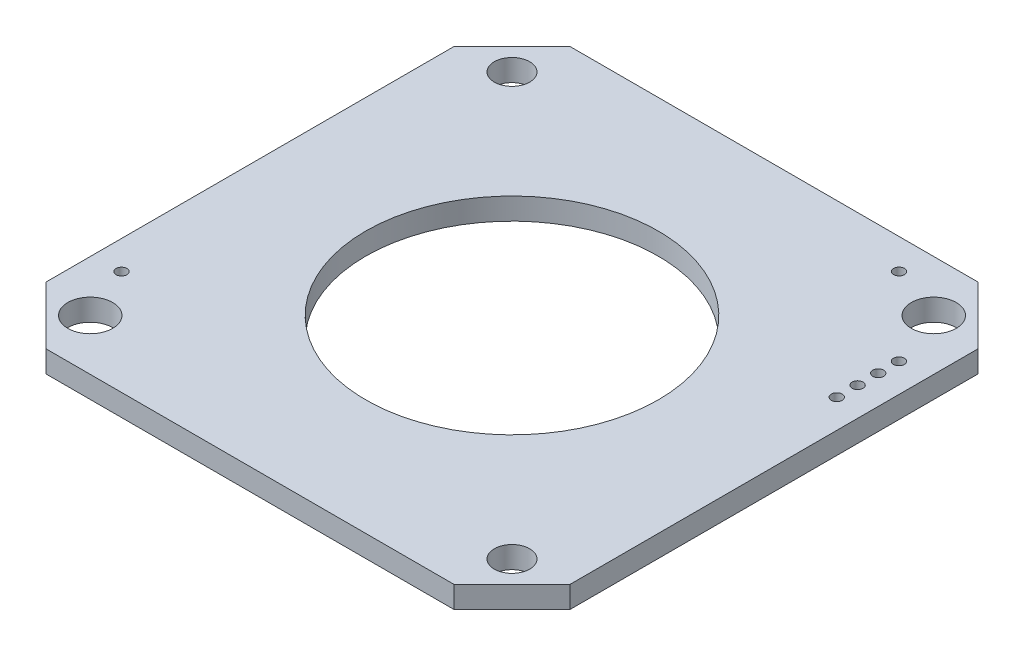
ISO-10303-21;
HEADER;
FILE_DESCRIPTION(('STEP AP214'),'2;1');
FILE_NAME('part.step','',(''),(''),'','','');
FILE_SCHEMA(('AUTOMOTIVE_DESIGN { 1 0 10303 214 1 1 1 1 }'));
ENDSEC;
DATA;
#1=APPLICATION_CONTEXT('core data for automotive mechanical design processes');
#2=APPLICATION_PROTOCOL_DEFINITION('international standard','automotive_design',2000,#1);
#3=PRODUCT_CONTEXT('',#1,'mechanical');
#4=PRODUCT('Part','Part','',(#3));
#5=PRODUCT_RELATED_PRODUCT_CATEGORY('part','',(#4));
#6=PRODUCT_DEFINITION_FORMATION('','',#4);
#7=PRODUCT_DEFINITION_CONTEXT('part definition',#1,'design');
#8=PRODUCT_DEFINITION('design','',#6,#7);
#9=PRODUCT_DEFINITION_SHAPE('','',#8);
#10=(LENGTH_UNIT() NAMED_UNIT(*) SI_UNIT(.MILLI.,.METRE.));
#11=(NAMED_UNIT(*) PLANE_ANGLE_UNIT() SI_UNIT($,.RADIAN.));
#12=(NAMED_UNIT(*) SI_UNIT($,.STERADIAN.) SOLID_ANGLE_UNIT());
#13=UNCERTAINTY_MEASURE_WITH_UNIT(LENGTH_MEASURE(1.E-05),#10,'distance_accuracy_value','');
#14=(GEOMETRIC_REPRESENTATION_CONTEXT(3) GLOBAL_UNCERTAINTY_ASSIGNED_CONTEXT((#13)) GLOBAL_UNIT_ASSIGNED_CONTEXT((#10,
#11,#12)) REPRESENTATION_CONTEXT('',''));
#15=CARTESIAN_POINT('',(0.,0.,0.));
#16=DIRECTION('',(0.,0.,1.));
#17=DIRECTION('',(1.,0.,0.));
#18=AXIS2_PLACEMENT_3D('',#15,#16,#17);
#19=CARTESIAN_POINT('',(0.,0.,0.));
#20=DIRECTION('',(0.,1.,0.));
#21=DIRECTION('',(1.,0.,0.));
#22=AXIS2_PLACEMENT_3D('',#19,#20,#21);
#23=PLANE('',#22);
#24=DIRECTION('',(0.,0.,-1.));
#25=VECTOR('',#24,1.);
#26=CARTESIAN_POINT('',(19.25,0.,15.));
#27=LINE('',#26,#25);
#28=CARTESIAN_POINT('',(19.25,0.,15.));
#29=VERTEX_POINT('',#28);
#30=CARTESIAN_POINT('',(19.25,0.,-15.));
#31=VERTEX_POINT('',#30);
#32=EDGE_CURVE('E36',#29,#31,#27,.T.);
#33=ORIENTED_EDGE('',*,*,#32,.F.);
#34=DIRECTION('',(0.707106781186548,0.,-0.707106781186548));
#35=VECTOR('',#34,1.);
#36=CARTESIAN_POINT('',(15.,0.,19.25));
#37=LINE('',#36,#35);
#38=CARTESIAN_POINT('',(15.,0.,19.25));
#39=VERTEX_POINT('',#38);
#40=EDGE_CURVE('E134',#39,#29,#37,.T.);
#41=ORIENTED_EDGE('',*,*,#40,.F.);
#42=DIRECTION('',(1.,0.,0.));
#43=VECTOR('',#42,1.);
#44=CARTESIAN_POINT('',(-15.,0.,19.25));
#45=LINE('',#44,#43);
#46=CARTESIAN_POINT('',(-15.,0.,19.25));
#47=VERTEX_POINT('',#46);
#48=EDGE_CURVE('E131',#47,#39,#45,.T.);
#49=ORIENTED_EDGE('',*,*,#48,.F.);
#50=DIRECTION('',(0.707106781186548,0.,0.707106781186548));
#51=VECTOR('',#50,1.);
#52=CARTESIAN_POINT('',(-19.25,0.,15.));
#53=LINE('',#52,#51);
#54=CARTESIAN_POINT('',(-19.25,0.,15.));
#55=VERTEX_POINT('',#54);
#56=EDGE_CURVE('E128',#55,#47,#53,.T.);
#57=ORIENTED_EDGE('',*,*,#56,.F.);
#58=DIRECTION('',(0.,0.,1.));
#59=VECTOR('',#58,1.);
#60=CARTESIAN_POINT('',(-19.25,0.,-15.));
#61=LINE('',#60,#59);
#62=CARTESIAN_POINT('',(-19.25,0.,-15.));
#63=VERTEX_POINT('',#62);
#64=EDGE_CURVE('E124',#63,#55,#61,.T.);
#65=ORIENTED_EDGE('',*,*,#64,.F.);
#66=DIRECTION('',(-0.707106781186548,0.,0.707106781186548));
#67=VECTOR('',#66,1.);
#68=CARTESIAN_POINT('',(-15.,0.,-19.25));
#69=LINE('',#68,#67);
#70=CARTESIAN_POINT('',(-15.,0.,-19.25));
#71=VERTEX_POINT('',#70);
#72=EDGE_CURVE('E120',#71,#63,#69,.T.);
#73=ORIENTED_EDGE('',*,*,#72,.F.);
#74=DIRECTION('',(-1.,0.,0.));
#75=VECTOR('',#74,1.);
#76=CARTESIAN_POINT('',(15.,0.,-19.25));
#77=LINE('',#76,#75);
#78=CARTESIAN_POINT('',(15.,0.,-19.25));
#79=VERTEX_POINT('',#78);
#80=EDGE_CURVE('E116',#79,#71,#77,.T.);
#81=ORIENTED_EDGE('',*,*,#80,.F.);
#82=DIRECTION('',(-0.707106781186548,0.,-0.707106781186548));
#83=VECTOR('',#82,1.);
#84=CARTESIAN_POINT('',(19.25,0.,-15.));
#85=LINE('',#84,#83);
#86=EDGE_CURVE('E115',#31,#79,#85,.T.);
#87=ORIENTED_EDGE('',*,*,#86,.F.);
#88=EDGE_LOOP('',(#33,#41,#49,#57,#65,#73,#81,#87));
#89=FACE_BOUND('',#88,.T.);
#90=CARTESIAN_POINT('',(0.,0.,0.));
#91=DIRECTION('',(0.,1.,0.));
#92=DIRECTION('',(-1.,0.,0.));
#93=AXIS2_PLACEMENT_3D('',#90,#91,#92);
#94=CIRCLE('',#93,10.75);
#95=CARTESIAN_POINT('',(-10.75,0.,0.));
#96=VERTEX_POINT('',#95);
#97=EDGE_CURVE('E11',#96,#96,#94,.T.);
#98=ORIENTED_EDGE('',*,*,#97,.T.);
#99=EDGE_LOOP('',(#98));
#100=FACE_BOUND('',#99,.T.);
#101=CARTESIAN_POINT('',(-15.5,0.,15.5));
#102=DIRECTION('',(0.,1.,0.));
#103=DIRECTION('',(-1.,0.,0.));
#104=AXIS2_PLACEMENT_3D('',#101,#102,#103);
#105=CIRCLE('',#104,1.65);
#106=CARTESIAN_POINT('',(-17.15,0.,15.5));
#107=VERTEX_POINT('',#106);
#108=EDGE_CURVE('E27',#107,#107,#105,.T.);
#109=ORIENTED_EDGE('',*,*,#108,.T.);
#110=EDGE_LOOP('',(#109));
#111=FACE_BOUND('',#110,.T.);
#112=CARTESIAN_POINT('',(15.5,0.,15.5));
#113=DIRECTION('',(0.,1.,0.));
#114=DIRECTION('',(-1.,0.,0.));
#115=AXIS2_PLACEMENT_3D('',#112,#113,#114);
#116=CIRCLE('',#115,1.3);
#117=CARTESIAN_POINT('',(14.2,0.,15.5));
#118=VERTEX_POINT('',#117);
#119=EDGE_CURVE('E153',#118,#118,#116,.T.);
#120=ORIENTED_EDGE('',*,*,#119,.T.);
#121=EDGE_LOOP('',(#120));
#122=FACE_BOUND('',#121,.T.);
#123=CARTESIAN_POINT('',(15.5,0.,-15.5));
#124=DIRECTION('',(0.,1.,0.));
#125=DIRECTION('',(-1.,0.,0.));
#126=AXIS2_PLACEMENT_3D('',#123,#124,#125);
#127=CIRCLE('',#126,1.65);
#128=CARTESIAN_POINT('',(13.85,0.,-15.5));
#129=VERTEX_POINT('',#128);
#130=EDGE_CURVE('E156',#129,#129,#127,.T.);
#131=ORIENTED_EDGE('',*,*,#130,.T.);
#132=EDGE_LOOP('',(#131));
#133=FACE_BOUND('',#132,.T.);
#134=CARTESIAN_POINT('',(-15.5,0.,-15.5));
#135=DIRECTION('',(0.,1.,0.));
#136=DIRECTION('',(-1.,0.,0.));
#137=AXIS2_PLACEMENT_3D('',#134,#135,#136);
#138=CIRCLE('',#137,1.3);
#139=CARTESIAN_POINT('',(-16.8,0.,-15.5));
#140=VERTEX_POINT('',#139);
#141=EDGE_CURVE('E159',#140,#140,#138,.T.);
#142=ORIENTED_EDGE('',*,*,#141,.T.);
#143=EDGE_LOOP('',(#142));
#144=FACE_BOUND('',#143,.T.);
#145=CARTESIAN_POINT('',(-17.14113742206,0.,11.5596073045));
#146=DIRECTION('',(0.,-1.,0.));
#147=DIRECTION('',(0.,0.,1.));
#148=AXIS2_PLACEMENT_3D('',#145,#146,#147);
#149=CIRCLE('',#148,0.4);
#150=CARTESIAN_POINT('',(-17.14113742206,0.,11.9596073045));
#151=VERTEX_POINT('',#150);
#152=EDGE_CURVE('E163',#151,#151,#149,.T.);
#153=ORIENTED_EDGE('',*,*,#152,.F.);
#154=EDGE_LOOP('',(#153));
#155=FACE_BOUND('',#154,.T.);
#156=CARTESIAN_POINT('',(11.42907727857,0.,-17.0201780966));
#157=DIRECTION('',(0.,-1.,0.));
#158=DIRECTION('',(0.,0.,1.));
#159=AXIS2_PLACEMENT_3D('',#156,#157,#158);
#160=CIRCLE('',#159,0.4);
#161=CARTESIAN_POINT('',(11.42907727857,0.,-16.6201780966));
#162=VERTEX_POINT('',#161);
#163=EDGE_CURVE('E167',#162,#162,#160,.T.);
#164=ORIENTED_EDGE('',*,*,#163,.F.);
#165=EDGE_LOOP('',(#164));
#166=FACE_BOUND('',#165,.T.);
#167=CARTESIAN_POINT('',(17.13893829593,0.,-11.30003921933));
#168=DIRECTION('',(0.,-1.,0.));
#169=DIRECTION('',(0.,0.,1.));
#170=AXIS2_PLACEMENT_3D('',#167,#168,#169);
#171=CIRCLE('',#170,0.4);
#172=CARTESIAN_POINT('',(17.13893829593,0.,-10.90003921933));
#173=VERTEX_POINT('',#172);
#174=EDGE_CURVE('E170',#173,#173,#171,.T.);
#175=ORIENTED_EDGE('',*,*,#174,.F.);
#176=EDGE_LOOP('',(#175));
#177=FACE_BOUND('',#176,.T.);
#178=CARTESIAN_POINT('',(17.13892260747,0.,-9.778579219413));
#179=DIRECTION('',(0.,-1.,0.));
#180=DIRECTION('',(0.,0.,1.));
#181=AXIS2_PLACEMENT_3D('',#178,#179,#180);
#182=CIRCLE('',#181,0.4);
#183=CARTESIAN_POINT('',(17.13892260747,0.,-9.378579219413));
#184=VERTEX_POINT('',#183);
#185=EDGE_CURVE('E173',#184,#184,#182,.T.);
#186=ORIENTED_EDGE('',*,*,#185,.F.);
#187=EDGE_LOOP('',(#186));
#188=FACE_BOUND('',#187,.T.);
#189=CARTESIAN_POINT('',(17.13890694519,0.,-8.259659219493));
#190=DIRECTION('',(0.,-1.,0.));
#191=DIRECTION('',(0.,0.,1.));
#192=AXIS2_PLACEMENT_3D('',#189,#190,#191);
#193=CIRCLE('',#192,0.4);
#194=CARTESIAN_POINT('',(17.13890694519,0.,-7.859659219493));
#195=VERTEX_POINT('',#194);
#196=EDGE_CURVE('E176',#195,#195,#193,.T.);
#197=ORIENTED_EDGE('',*,*,#196,.F.);
#198=EDGE_LOOP('',(#197));
#199=FACE_BOUND('',#198,.T.);
#200=CARTESIAN_POINT('',(17.13889117816,0.,-6.730579219575));
#201=DIRECTION('',(0.,-1.,0.));
#202=DIRECTION('',(0.,0.,1.));
#203=AXIS2_PLACEMENT_3D('',#200,#201,#202);
#204=CIRCLE('',#203,0.4);
#205=CARTESIAN_POINT('',(17.13889117816,0.,-6.330579219575));
#206=VERTEX_POINT('',#205);
#207=EDGE_CURVE('E179',#206,#206,#204,.T.);
#208=ORIENTED_EDGE('',*,*,#207,.F.);
#209=EDGE_LOOP('',(#208));
#210=FACE_BOUND('',#209,.T.);
#211=ADVANCED_FACE('F17',(#89,#100,#111,#122,#133,#144,#155,#166,#177,#188,#199,#210),#23,.F.);
#212=CARTESIAN_POINT('',(0.,1.6,0.));
#213=DIRECTION('',(0.,1.,0.));
#214=DIRECTION('',(1.,0.,0.));
#215=AXIS2_PLACEMENT_3D('',#212,#213,#214);
#216=CYLINDRICAL_SURFACE('',#215,10.75);
#217=ORIENTED_EDGE('',*,*,#97,.F.);
#218=EDGE_LOOP('',(#217));
#219=FACE_BOUND('',#218,.T.);
#220=CARTESIAN_POINT('',(0.,1.6,0.));
#221=DIRECTION('',(0.,1.,0.));
#222=DIRECTION('',(1.,0.,0.));
#223=AXIS2_PLACEMENT_3D('',#220,#221,#222);
#224=CIRCLE('',#223,10.75);
#225=CARTESIAN_POINT('',(10.75,1.6,0.));
#226=VERTEX_POINT('',#225);
#227=EDGE_CURVE('E162',#226,#226,#224,.T.);
#228=ORIENTED_EDGE('',*,*,#227,.T.);
#229=EDGE_LOOP('',(#228));
#230=FACE_BOUND('',#229,.T.);
#231=ADVANCED_FACE('F229',(#219,#230),#216,.F.);
#232=CARTESIAN_POINT('',(0.,1.6,0.));
#233=DIRECTION('',(0.,1.,0.));
#234=DIRECTION('',(1.,0.,0.));
#235=AXIS2_PLACEMENT_3D('',#232,#233,#234);
#236=PLANE('',#235);
#237=DIRECTION('',(-1.,0.,0.));
#238=VECTOR('',#237,1.);
#239=CARTESIAN_POINT('',(15.,1.6,-19.25));
#240=LINE('',#239,#238);
#241=CARTESIAN_POINT('',(15.,1.6,-19.25));
#242=VERTEX_POINT('',#241);
#243=CARTESIAN_POINT('',(-15.,1.6,-19.25));
#244=VERTEX_POINT('',#243);
#245=EDGE_CURVE('E184',#242,#244,#240,.T.);
#246=ORIENTED_EDGE('',*,*,#245,.T.);
#247=DIRECTION('',(-0.707106781186548,0.,0.707106781186548));
#248=VECTOR('',#247,1.);
#249=CARTESIAN_POINT('',(-15.,1.6,-19.25));
#250=LINE('',#249,#248);
#251=CARTESIAN_POINT('',(-19.25,1.6,-15.));
#252=VERTEX_POINT('',#251);
#253=EDGE_CURVE('E186',#244,#252,#250,.T.);
#254=ORIENTED_EDGE('',*,*,#253,.T.);
#255=DIRECTION('',(0.,0.,1.));
#256=VECTOR('',#255,1.);
#257=CARTESIAN_POINT('',(-19.25,1.6,-15.));
#258=LINE('',#257,#256);
#259=CARTESIAN_POINT('',(-19.25,1.6,15.));
#260=VERTEX_POINT('',#259);
#261=EDGE_CURVE('E189',#252,#260,#258,.T.);
#262=ORIENTED_EDGE('',*,*,#261,.T.);
#263=DIRECTION('',(0.707106781186548,0.,0.707106781186548));
#264=VECTOR('',#263,1.);
#265=CARTESIAN_POINT('',(-19.25,1.6,15.));
#266=LINE('',#265,#264);
#267=CARTESIAN_POINT('',(-15.,1.6,19.25));
#268=VERTEX_POINT('',#267);
#269=EDGE_CURVE('E192',#260,#268,#266,.T.);
#270=ORIENTED_EDGE('',*,*,#269,.T.);
#271=DIRECTION('',(1.,0.,0.));
#272=VECTOR('',#271,1.);
#273=CARTESIAN_POINT('',(-15.,1.6,19.25));
#274=LINE('',#273,#272);
#275=CARTESIAN_POINT('',(15.,1.6,19.25));
#276=VERTEX_POINT('',#275);
#277=EDGE_CURVE('E195',#268,#276,#274,.T.);
#278=ORIENTED_EDGE('',*,*,#277,.T.);
#279=DIRECTION('',(0.707106781186548,0.,-0.707106781186548));
#280=VECTOR('',#279,1.);
#281=CARTESIAN_POINT('',(15.,1.6,19.25));
#282=LINE('',#281,#280);
#283=CARTESIAN_POINT('',(19.25,1.6,15.));
#284=VERTEX_POINT('',#283);
#285=EDGE_CURVE('E100',#276,#284,#282,.T.);
#286=ORIENTED_EDGE('',*,*,#285,.T.);
#287=DIRECTION('',(0.,0.,-1.));
#288=VECTOR('',#287,1.);
#289=CARTESIAN_POINT('',(19.25,1.6,15.));
#290=LINE('',#289,#288);
#291=CARTESIAN_POINT('',(19.25,1.6,-15.));
#292=VERTEX_POINT('',#291);
#293=EDGE_CURVE('E80',#284,#292,#290,.T.);
#294=ORIENTED_EDGE('',*,*,#293,.T.);
#295=DIRECTION('',(-0.707106781186548,0.,-0.707106781186548));
#296=VECTOR('',#295,1.);
#297=CARTESIAN_POINT('',(19.25,1.6,-15.));
#298=LINE('',#297,#296);
#299=EDGE_CURVE('E86',#292,#242,#298,.T.);
#300=ORIENTED_EDGE('',*,*,#299,.T.);
#301=EDGE_LOOP('',(#246,#254,#262,#270,#278,#286,#294,#300));
#302=FACE_BOUND('',#301,.T.);
#303=ORIENTED_EDGE('',*,*,#227,.F.);
#304=EDGE_LOOP('',(#303));
#305=FACE_BOUND('',#304,.T.);
#306=CARTESIAN_POINT('',(-15.5,1.6,15.5));
#307=DIRECTION('',(0.,1.,0.));
#308=DIRECTION('',(-1.,0.,0.));
#309=AXIS2_PLACEMENT_3D('',#306,#307,#308);
#310=CIRCLE('',#309,1.65);
#311=CARTESIAN_POINT('',(-17.15,1.6,15.5));
#312=VERTEX_POINT('',#311);
#313=EDGE_CURVE('E104',#312,#312,#310,.T.);
#314=ORIENTED_EDGE('',*,*,#313,.F.);
#315=EDGE_LOOP('',(#314));
#316=FACE_BOUND('',#315,.T.);
#317=CARTESIAN_POINT('',(15.5,1.6,15.5));
#318=DIRECTION('',(0.,1.,0.));
#319=DIRECTION('',(-1.,0.,0.));
#320=AXIS2_PLACEMENT_3D('',#317,#318,#319);
#321=CIRCLE('',#320,1.3);
#322=CARTESIAN_POINT('',(14.2,1.6,15.5));
#323=VERTEX_POINT('',#322);
#324=EDGE_CURVE('E108',#323,#323,#321,.T.);
#325=ORIENTED_EDGE('',*,*,#324,.F.);
#326=EDGE_LOOP('',(#325));
#327=FACE_BOUND('',#326,.T.);
#328=CARTESIAN_POINT('',(15.5,1.6,-15.5));
#329=DIRECTION('',(0.,1.,0.));
#330=DIRECTION('',(-1.,0.,0.));
#331=AXIS2_PLACEMENT_3D('',#328,#329,#330);
#332=CIRCLE('',#331,1.65);
#333=CARTESIAN_POINT('',(13.85,1.6,-15.5));
#334=VERTEX_POINT('',#333);
#335=EDGE_CURVE('E200',#334,#334,#332,.T.);
#336=ORIENTED_EDGE('',*,*,#335,.F.);
#337=EDGE_LOOP('',(#336));
#338=FACE_BOUND('',#337,.T.);
#339=CARTESIAN_POINT('',(-15.5,1.6,-15.5));
#340=DIRECTION('',(0.,1.,0.));
#341=DIRECTION('',(-1.,0.,0.));
#342=AXIS2_PLACEMENT_3D('',#339,#340,#341);
#343=CIRCLE('',#342,1.3);
#344=CARTESIAN_POINT('',(-16.8,1.6,-15.5));
#345=VERTEX_POINT('',#344);
#346=EDGE_CURVE('E166',#345,#345,#343,.T.);
#347=ORIENTED_EDGE('',*,*,#346,.F.);
#348=EDGE_LOOP('',(#347));
#349=FACE_BOUND('',#348,.T.);
#350=CARTESIAN_POINT('',(-17.14113742206,1.6,11.5596073045));
#351=DIRECTION('',(0.,-1.,0.));
#352=DIRECTION('',(0.,0.,1.));
#353=AXIS2_PLACEMENT_3D('',#350,#351,#352);
#354=CIRCLE('',#353,0.4);
#355=CARTESIAN_POINT('',(-17.14113742206,1.6,11.9596073045));
#356=VERTEX_POINT('',#355);
#357=EDGE_CURVE('E95',#356,#356,#354,.T.);
#358=ORIENTED_EDGE('',*,*,#357,.T.);
#359=EDGE_LOOP('',(#358));
#360=FACE_BOUND('',#359,.T.);
#361=CARTESIAN_POINT('',(11.42907727857,1.6,-17.0201780966));
#362=DIRECTION('',(0.,-1.,0.));
#363=DIRECTION('',(0.,0.,1.));
#364=AXIS2_PLACEMENT_3D('',#361,#362,#363);
#365=CIRCLE('',#364,0.4);
#366=CARTESIAN_POINT('',(11.42907727857,1.6,-16.6201780966));
#367=VERTEX_POINT('',#366);
#368=EDGE_CURVE('E207',#367,#367,#365,.T.);
#369=ORIENTED_EDGE('',*,*,#368,.T.);
#370=EDGE_LOOP('',(#369));
#371=FACE_BOUND('',#370,.T.);
#372=CARTESIAN_POINT('',(17.13893829593,1.6,-11.30003921933));
#373=DIRECTION('',(0.,-1.,0.));
#374=DIRECTION('',(0.,0.,1.));
#375=AXIS2_PLACEMENT_3D('',#372,#373,#374);
#376=CIRCLE('',#375,0.4);
#377=CARTESIAN_POINT('',(17.13893829593,1.6,-10.90003921933));
#378=VERTEX_POINT('',#377);
#379=EDGE_CURVE('E210',#378,#378,#376,.T.);
#380=ORIENTED_EDGE('',*,*,#379,.T.);
#381=EDGE_LOOP('',(#380));
#382=FACE_BOUND('',#381,.T.);
#383=CARTESIAN_POINT('',(17.13892260747,1.6,-9.778579219413));
#384=DIRECTION('',(0.,-1.,0.));
#385=DIRECTION('',(0.,0.,1.));
#386=AXIS2_PLACEMENT_3D('',#383,#384,#385);
#387=CIRCLE('',#386,0.4);
#388=CARTESIAN_POINT('',(17.13892260747,1.6,-9.378579219413));
#389=VERTEX_POINT('',#388);
#390=EDGE_CURVE('E213',#389,#389,#387,.T.);
#391=ORIENTED_EDGE('',*,*,#390,.T.);
#392=EDGE_LOOP('',(#391));
#393=FACE_BOUND('',#392,.T.);
#394=CARTESIAN_POINT('',(17.13890694519,1.6,-8.259659219493));
#395=DIRECTION('',(0.,-1.,0.));
#396=DIRECTION('',(0.,0.,1.));
#397=AXIS2_PLACEMENT_3D('',#394,#395,#396);
#398=CIRCLE('',#397,0.4);
#399=CARTESIAN_POINT('',(17.13890694519,1.6,-7.859659219493));
#400=VERTEX_POINT('',#399);
#401=EDGE_CURVE('E215',#400,#400,#398,.T.);
#402=ORIENTED_EDGE('',*,*,#401,.T.);
#403=EDGE_LOOP('',(#402));
#404=FACE_BOUND('',#403,.T.);
#405=CARTESIAN_POINT('',(17.13889117816,1.6,-6.730579219575));
#406=DIRECTION('',(0.,-1.,0.));
#407=DIRECTION('',(0.,0.,1.));
#408=AXIS2_PLACEMENT_3D('',#405,#406,#407);
#409=CIRCLE('',#408,0.4);
#410=CARTESIAN_POINT('',(17.13889117816,1.6,-6.330579219575));
#411=VERTEX_POINT('',#410);
#412=EDGE_CURVE('E112',#411,#411,#409,.T.);
#413=ORIENTED_EDGE('',*,*,#412,.T.);
#414=EDGE_LOOP('',(#413));
#415=FACE_BOUND('',#414,.T.);
#416=ADVANCED_FACE('F97',(#302,#305,#316,#327,#338,#349,#360,#371,#382,#393,#404,#415),#236,.T.);
#417=CARTESIAN_POINT('',(19.25,0.,-15.));
#418=DIRECTION('',(-0.707106781186548,0.,0.707106781186548));
#419=DIRECTION('',(-0.707106781186548,0.,-0.707106781186548));
#420=AXIS2_PLACEMENT_3D('',#417,#418,#419);
#421=PLANE('',#420);
#422=DIRECTION('',(0.,1.,0.));
#423=VECTOR('',#422,1.);
#424=CARTESIAN_POINT('',(19.25,0.,-15.));
#425=LINE('',#424,#423);
#426=EDGE_CURVE('E89',#31,#292,#425,.T.);
#427=ORIENTED_EDGE('',*,*,#426,.F.);
#428=ORIENTED_EDGE('',*,*,#86,.T.);
#429=DIRECTION('',(0.,1.,0.));
#430=VECTOR('',#429,1.);
#431=CARTESIAN_POINT('',(15.,0.,-19.25));
#432=LINE('',#431,#430);
#433=EDGE_CURVE('E91',#79,#242,#432,.T.);
#434=ORIENTED_EDGE('',*,*,#433,.T.);
#435=ORIENTED_EDGE('',*,*,#299,.F.);
#436=EDGE_LOOP('',(#427,#428,#434,#435));
#437=FACE_BOUND('',#436,.T.);
#438=ADVANCED_FACE('F87',(#437),#421,.F.);
#439=CARTESIAN_POINT('',(19.25,0.,-19.25));
#440=DIRECTION('',(0.,0.,-1.));
#441=DIRECTION('',(-1.,0.,0.));
#442=AXIS2_PLACEMENT_3D('',#439,#440,#441);
#443=PLANE('',#442);
#444=ORIENTED_EDGE('',*,*,#80,.T.);
#445=DIRECTION('',(0.,1.,0.));
#446=VECTOR('',#445,1.);
#447=CARTESIAN_POINT('',(-15.,0.,-19.25));
#448=LINE('',#447,#446);
#449=EDGE_CURVE('E117',#71,#244,#448,.T.);
#450=ORIENTED_EDGE('',*,*,#449,.T.);
#451=ORIENTED_EDGE('',*,*,#245,.F.);
#452=ORIENTED_EDGE('',*,*,#433,.F.);
#453=EDGE_LOOP('',(#444,#450,#451,#452));
#454=FACE_BOUND('',#453,.T.);
#455=ADVANCED_FACE('F244',(#454),#443,.T.);
#456=CARTESIAN_POINT('',(-15.,0.,-19.25));
#457=DIRECTION('',(0.707106781186548,0.,0.707106781186548));
#458=DIRECTION('',(-0.707106781186548,0.,0.707106781186548));
#459=AXIS2_PLACEMENT_3D('',#456,#457,#458);
#460=PLANE('',#459);
#461=ORIENTED_EDGE('',*,*,#449,.F.);
#462=ORIENTED_EDGE('',*,*,#72,.T.);
#463=DIRECTION('',(0.,1.,0.));
#464=VECTOR('',#463,1.);
#465=CARTESIAN_POINT('',(-19.25,0.,-15.));
#466=LINE('',#465,#464);
#467=EDGE_CURVE('E121',#63,#252,#466,.T.);
#468=ORIENTED_EDGE('',*,*,#467,.T.);
#469=ORIENTED_EDGE('',*,*,#253,.F.);
#470=EDGE_LOOP('',(#461,#462,#468,#469));
#471=FACE_BOUND('',#470,.T.);
#472=ADVANCED_FACE('F247',(#471),#460,.F.);
#473=CARTESIAN_POINT('',(-19.25,0.,-19.25));
#474=DIRECTION('',(-1.,0.,0.));
#475=DIRECTION('',(0.,0.,1.));
#476=AXIS2_PLACEMENT_3D('',#473,#474,#475);
#477=PLANE('',#476);
#478=ORIENTED_EDGE('',*,*,#64,.T.);
#479=DIRECTION('',(0.,1.,0.));
#480=VECTOR('',#479,1.);
#481=CARTESIAN_POINT('',(-19.25,0.,15.));
#482=LINE('',#481,#480);
#483=EDGE_CURVE('E125',#55,#260,#482,.T.);
#484=ORIENTED_EDGE('',*,*,#483,.T.);
#485=ORIENTED_EDGE('',*,*,#261,.F.);
#486=ORIENTED_EDGE('',*,*,#467,.F.);
#487=EDGE_LOOP('',(#478,#484,#485,#486));
#488=FACE_BOUND('',#487,.T.);
#489=ADVANCED_FACE('F251',(#488),#477,.T.);
#490=CARTESIAN_POINT('',(-19.25,0.,15.));
#491=DIRECTION('',(0.707106781186548,0.,-0.707106781186548));
#492=DIRECTION('',(0.707106781186548,0.,0.707106781186548));
#493=AXIS2_PLACEMENT_3D('',#490,#491,#492);
#494=PLANE('',#493);
#495=ORIENTED_EDGE('',*,*,#483,.F.);
#496=ORIENTED_EDGE('',*,*,#56,.T.);
#497=DIRECTION('',(0.,1.,0.));
#498=VECTOR('',#497,1.);
#499=CARTESIAN_POINT('',(-15.,0.,19.25));
#500=LINE('',#499,#498);
#501=EDGE_CURVE('E129',#47,#268,#500,.T.);
#502=ORIENTED_EDGE('',*,*,#501,.T.);
#503=ORIENTED_EDGE('',*,*,#269,.F.);
#504=EDGE_LOOP('',(#495,#496,#502,#503));
#505=FACE_BOUND('',#504,.T.);
#506=ADVANCED_FACE('F255',(#505),#494,.F.);
#507=CARTESIAN_POINT('',(-19.25,0.,19.25));
#508=DIRECTION('',(0.,0.,1.));
#509=DIRECTION('',(1.,0.,0.));
#510=AXIS2_PLACEMENT_3D('',#507,#508,#509);
#511=PLANE('',#510);
#512=ORIENTED_EDGE('',*,*,#277,.F.);
#513=ORIENTED_EDGE('',*,*,#501,.F.);
#514=ORIENTED_EDGE('',*,*,#48,.T.);
#515=DIRECTION('',(0.,1.,0.));
#516=VECTOR('',#515,1.);
#517=CARTESIAN_POINT('',(15.,0.,19.25));
#518=LINE('',#517,#516);
#519=EDGE_CURVE('E132',#39,#276,#518,.T.);
#520=ORIENTED_EDGE('',*,*,#519,.T.);
#521=EDGE_LOOP('',(#512,#513,#514,#520));
#522=FACE_BOUND('',#521,.T.);
#523=ADVANCED_FACE('F259',(#522),#511,.T.);
#524=CARTESIAN_POINT('',(15.,0.,19.25));
#525=DIRECTION('',(-0.707106781186548,0.,-0.707106781186548));
#526=DIRECTION('',(0.707106781186548,0.,-0.707106781186548));
#527=AXIS2_PLACEMENT_3D('',#524,#525,#526);
#528=PLANE('',#527);
#529=ORIENTED_EDGE('',*,*,#519,.F.);
#530=ORIENTED_EDGE('',*,*,#40,.T.);
#531=DIRECTION('',(0.,1.,0.));
#532=VECTOR('',#531,1.);
#533=CARTESIAN_POINT('',(19.25,0.,15.));
#534=LINE('',#533,#532);
#535=EDGE_CURVE('E21',#29,#284,#534,.T.);
#536=ORIENTED_EDGE('',*,*,#535,.T.);
#537=ORIENTED_EDGE('',*,*,#285,.F.);
#538=EDGE_LOOP('',(#529,#530,#536,#537));
#539=FACE_BOUND('',#538,.T.);
#540=ADVANCED_FACE('F263',(#539),#528,.F.);
#541=CARTESIAN_POINT('',(19.25,0.,19.25));
#542=DIRECTION('',(1.,0.,0.));
#543=DIRECTION('',(0.,0.,-1.));
#544=AXIS2_PLACEMENT_3D('',#541,#542,#543);
#545=PLANE('',#544);
#546=ORIENTED_EDGE('',*,*,#293,.F.);
#547=ORIENTED_EDGE('',*,*,#535,.F.);
#548=ORIENTED_EDGE('',*,*,#32,.T.);
#549=ORIENTED_EDGE('',*,*,#426,.T.);
#550=EDGE_LOOP('',(#546,#547,#548,#549));
#551=FACE_BOUND('',#550,.T.);
#552=ADVANCED_FACE('F103',(#551),#545,.T.);
#553=CARTESIAN_POINT('',(-15.5,1.6,15.5));
#554=DIRECTION('',(0.,1.,0.));
#555=DIRECTION('',(1.,0.,0.));
#556=AXIS2_PLACEMENT_3D('',#553,#554,#555);
#557=CYLINDRICAL_SURFACE('',#556,1.65);
#558=ORIENTED_EDGE('',*,*,#108,.F.);
#559=EDGE_LOOP('',(#558));
#560=FACE_BOUND('',#559,.T.);
#561=ORIENTED_EDGE('',*,*,#313,.T.);
#562=EDGE_LOOP('',(#561));
#563=FACE_BOUND('',#562,.T.);
#564=ADVANCED_FACE('F268',(#560,#563),#557,.F.);
#565=CARTESIAN_POINT('',(15.5,1.6,15.5));
#566=DIRECTION('',(0.,1.,0.));
#567=DIRECTION('',(1.,0.,0.));
#568=AXIS2_PLACEMENT_3D('',#565,#566,#567);
#569=CYLINDRICAL_SURFACE('',#568,1.3);
#570=ORIENTED_EDGE('',*,*,#119,.F.);
#571=EDGE_LOOP('',(#570));
#572=FACE_BOUND('',#571,.T.);
#573=ORIENTED_EDGE('',*,*,#324,.T.);
#574=EDGE_LOOP('',(#573));
#575=FACE_BOUND('',#574,.T.);
#576=ADVANCED_FACE('F271',(#572,#575),#569,.F.);
#577=CARTESIAN_POINT('',(15.5,1.6,-15.5));
#578=DIRECTION('',(0.,1.,0.));
#579=DIRECTION('',(1.,0.,0.));
#580=AXIS2_PLACEMENT_3D('',#577,#578,#579);
#581=CYLINDRICAL_SURFACE('',#580,1.65);
#582=ORIENTED_EDGE('',*,*,#130,.F.);
#583=EDGE_LOOP('',(#582));
#584=FACE_BOUND('',#583,.T.);
#585=ORIENTED_EDGE('',*,*,#335,.T.);
#586=EDGE_LOOP('',(#585));
#587=FACE_BOUND('',#586,.T.);
#588=ADVANCED_FACE('F275',(#584,#587),#581,.F.);
#589=CARTESIAN_POINT('',(-15.5,1.6,-15.5));
#590=DIRECTION('',(0.,1.,0.));
#591=DIRECTION('',(1.,0.,0.));
#592=AXIS2_PLACEMENT_3D('',#589,#590,#591);
#593=CYLINDRICAL_SURFACE('',#592,1.3);
#594=ORIENTED_EDGE('',*,*,#141,.F.);
#595=EDGE_LOOP('',(#594));
#596=FACE_BOUND('',#595,.T.);
#597=ORIENTED_EDGE('',*,*,#346,.T.);
#598=EDGE_LOOP('',(#597));
#599=FACE_BOUND('',#598,.T.);
#600=ADVANCED_FACE('F279',(#596,#599),#593,.F.);
#601=CARTESIAN_POINT('',(-17.14113742206,0.,11.5596073045));
#602=DIRECTION('',(0.,-1.,0.));
#603=DIRECTION('',(0.,0.,-1.));
#604=AXIS2_PLACEMENT_3D('',#601,#602,#603);
#605=CYLINDRICAL_SURFACE('',#604,0.4);
#606=ORIENTED_EDGE('',*,*,#357,.F.);
#607=EDGE_LOOP('',(#606));
#608=FACE_BOUND('',#607,.T.);
#609=ORIENTED_EDGE('',*,*,#152,.T.);
#610=EDGE_LOOP('',(#609));
#611=FACE_BOUND('',#610,.T.);
#612=ADVANCED_FACE('F283',(#608,#611),#605,.F.);
#613=CARTESIAN_POINT('',(11.42907727857,0.,-17.0201780966));
#614=DIRECTION('',(0.,-1.,0.));
#615=DIRECTION('',(0.,0.,-1.));
#616=AXIS2_PLACEMENT_3D('',#613,#614,#615);
#617=CYLINDRICAL_SURFACE('',#616,0.4);
#618=ORIENTED_EDGE('',*,*,#368,.F.);
#619=EDGE_LOOP('',(#618));
#620=FACE_BOUND('',#619,.T.);
#621=ORIENTED_EDGE('',*,*,#163,.T.);
#622=EDGE_LOOP('',(#621));
#623=FACE_BOUND('',#622,.T.);
#624=ADVANCED_FACE('F287',(#620,#623),#617,.F.);
#625=CARTESIAN_POINT('',(17.13893829593,0.,-11.30003921933));
#626=DIRECTION('',(0.,-1.,0.));
#627=DIRECTION('',(0.,0.,-1.));
#628=AXIS2_PLACEMENT_3D('',#625,#626,#627);
#629=CYLINDRICAL_SURFACE('',#628,0.4);
#630=ORIENTED_EDGE('',*,*,#379,.F.);
#631=EDGE_LOOP('',(#630));
#632=FACE_BOUND('',#631,.T.);
#633=ORIENTED_EDGE('',*,*,#174,.T.);
#634=EDGE_LOOP('',(#633));
#635=FACE_BOUND('',#634,.T.);
#636=ADVANCED_FACE('F291',(#632,#635),#629,.F.);
#637=CARTESIAN_POINT('',(17.13892260747,0.,-9.778579219413));
#638=DIRECTION('',(0.,-1.,0.));
#639=DIRECTION('',(0.,0.,-1.));
#640=AXIS2_PLACEMENT_3D('',#637,#638,#639);
#641=CYLINDRICAL_SURFACE('',#640,0.4);
#642=ORIENTED_EDGE('',*,*,#390,.F.);
#643=EDGE_LOOP('',(#642));
#644=FACE_BOUND('',#643,.T.);
#645=ORIENTED_EDGE('',*,*,#185,.T.);
#646=EDGE_LOOP('',(#645));
#647=FACE_BOUND('',#646,.T.);
#648=ADVANCED_FACE('F295',(#644,#647),#641,.F.);
#649=CARTESIAN_POINT('',(17.13890694519,0.,-8.259659219493));
#650=DIRECTION('',(0.,-1.,0.));
#651=DIRECTION('',(0.,0.,-1.));
#652=AXIS2_PLACEMENT_3D('',#649,#650,#651);
#653=CYLINDRICAL_SURFACE('',#652,0.4);
#654=ORIENTED_EDGE('',*,*,#401,.F.);
#655=EDGE_LOOP('',(#654));
#656=FACE_BOUND('',#655,.T.);
#657=ORIENTED_EDGE('',*,*,#196,.T.);
#658=EDGE_LOOP('',(#657));
#659=FACE_BOUND('',#658,.T.);
#660=ADVANCED_FACE('F225',(#656,#659),#653,.F.);
#661=CARTESIAN_POINT('',(17.13889117816,0.,-6.730579219575));
#662=DIRECTION('',(0.,-1.,0.));
#663=DIRECTION('',(0.,0.,-1.));
#664=AXIS2_PLACEMENT_3D('',#661,#662,#663);
#665=CYLINDRICAL_SURFACE('',#664,0.4);
#666=ORIENTED_EDGE('',*,*,#412,.F.);
#667=EDGE_LOOP('',(#666));
#668=FACE_BOUND('',#667,.T.);
#669=ORIENTED_EDGE('',*,*,#207,.T.);
#670=EDGE_LOOP('',(#669));
#671=FACE_BOUND('',#670,.T.);
#672=ADVANCED_FACE('F19',(#668,#671),#665,.F.);
#673=CLOSED_SHELL('',(#211,#231,#416,#438,#455,#472,#489,#506,#523,#540,#552,#564,#576,#588,
#600,#612,#624,#636,#648,#660,#672));
#674=MANIFOLD_SOLID_BREP('B1',#673);
#675=ADVANCED_BREP_SHAPE_REPRESENTATION('',(#18,#674),#14);
#676=SHAPE_DEFINITION_REPRESENTATION(#9,#675);
ENDSEC;
END-ISO-10303-21;
